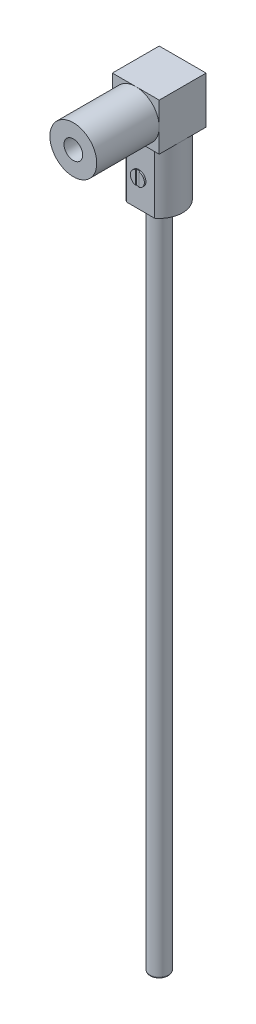
ISO-10303-21;
HEADER;
FILE_DESCRIPTION(('STEP AP214'),'2;1');
FILE_NAME('part.step','',(''),(''),'','','');
FILE_SCHEMA(('AUTOMOTIVE_DESIGN { 1 0 10303 214 1 1 1 1 }'));
ENDSEC;
DATA;
#1=APPLICATION_CONTEXT('core data for automotive mechanical design processes');
#2=APPLICATION_PROTOCOL_DEFINITION('international standard','automotive_design',2000,#1);
#3=PRODUCT_CONTEXT('',#1,'mechanical');
#4=PRODUCT('Part','Part','',(#3));
#5=PRODUCT_RELATED_PRODUCT_CATEGORY('part','',(#4));
#6=PRODUCT_DEFINITION_FORMATION('','',#4);
#7=PRODUCT_DEFINITION_CONTEXT('part definition',#1,'design');
#8=PRODUCT_DEFINITION('design','',#6,#7);
#9=PRODUCT_DEFINITION_SHAPE('','',#8);
#10=(LENGTH_UNIT() NAMED_UNIT(*) SI_UNIT(.MILLI.,.METRE.));
#11=(NAMED_UNIT(*) PLANE_ANGLE_UNIT() SI_UNIT($,.RADIAN.));
#12=(NAMED_UNIT(*) SI_UNIT($,.STERADIAN.) SOLID_ANGLE_UNIT());
#13=UNCERTAINTY_MEASURE_WITH_UNIT(LENGTH_MEASURE(1.E-05),#10,'distance_accuracy_value','');
#14=(GEOMETRIC_REPRESENTATION_CONTEXT(3) GLOBAL_UNCERTAINTY_ASSIGNED_CONTEXT((#13)) GLOBAL_UNIT_ASSIGNED_CONTEXT((#10,
#11,#12)) REPRESENTATION_CONTEXT('',''));
#15=CARTESIAN_POINT('',(0.,0.,0.));
#16=DIRECTION('',(0.,0.,1.));
#17=DIRECTION('',(1.,0.,0.));
#18=AXIS2_PLACEMENT_3D('',#15,#16,#17);
#19=CARTESIAN_POINT('',(15.,-21.5,29.));
#20=DIRECTION('',(0.,0.,1.));
#21=DIRECTION('',(1.,0.,0.));
#22=AXIS2_PLACEMENT_3D('',#19,#20,#21);
#23=PLANE('',#22);
#24=DIRECTION('',(0.,1.,0.));
#25=VECTOR('',#24,1.);
#26=CARTESIAN_POINT('',(16.2,-17.1629503115597,29.));
#27=LINE('',#26,#25);
#28=CARTESIAN_POINT('',(16.2,-25.8370496884403,29.));
#29=VERTEX_POINT('',#28);
#30=CARTESIAN_POINT('',(16.2,-17.1629503115597,29.));
#31=VERTEX_POINT('',#30);
#32=EDGE_CURVE('E147',#29,#31,#27,.T.);
#33=ORIENTED_EDGE('',*,*,#32,.F.);
#34=CARTESIAN_POINT('',(15.,-21.5,29.));
#35=DIRECTION('',(0.,0.,1.));
#36=DIRECTION('',(1.,0.,0.));
#37=AXIS2_PLACEMENT_3D('',#34,#35,#36);
#38=CIRCLE('',#37,4.5);
#39=EDGE_CURVE('E160',#29,#31,#38,.T.);
#40=ORIENTED_EDGE('',*,*,#39,.T.);
#41=EDGE_LOOP('',(#33,#40));
#42=FACE_BOUND('',#41,.T.);
#43=ADVANCED_FACE('F34',(#42),#23,.T.);
#44=CARTESIAN_POINT('',(0.,0.,30.));
#45=DIRECTION('',(0.,1.,0.));
#46=DIRECTION('',(0.,0.,1.));
#47=AXIS2_PLACEMENT_3D('',#44,#45,#46);
#48=PLANE('',#47);
#49=CARTESIAN_POINT('',(15.,0.,15.));
#50=DIRECTION('',(0.,-1.,0.));
#51=DIRECTION('',(0.,0.,-1.));
#52=AXIS2_PLACEMENT_3D('',#49,#50,#51);
#53=CIRCLE('',#52,15.);
#54=CARTESIAN_POINT('',(0.,0.,15.));
#55=VERTEX_POINT('',#54);
#56=CARTESIAN_POINT('',(15.,0.,0.));
#57=VERTEX_POINT('',#56);
#58=EDGE_CURVE('E178',#55,#57,#53,.T.);
#59=ORIENTED_EDGE('',*,*,#58,.F.);
#60=DIRECTION('',(0.,0.,-1.));
#61=VECTOR('',#60,1.);
#62=CARTESIAN_POINT('',(0.,0.,30.));
#63=LINE('',#62,#61);
#64=CARTESIAN_POINT('',(0.,0.,0.));
#65=VERTEX_POINT('',#64);
#66=EDGE_CURVE('E238',#55,#65,#63,.T.);
#67=ORIENTED_EDGE('',*,*,#66,.T.);
#68=DIRECTION('',(1.,0.,0.));
#69=VECTOR('',#68,1.);
#70=CARTESIAN_POINT('',(0.,0.,0.));
#71=LINE('',#70,#69);
#72=EDGE_CURVE('E222',#65,#57,#71,.T.);
#73=ORIENTED_EDGE('',*,*,#72,.T.);
#74=EDGE_LOOP('',(#59,#67,#73));
#75=FACE_BOUND('',#74,.T.);
#76=ADVANCED_FACE('F264',(#75),#48,.F.);
#77=CARTESIAN_POINT('',(30.,0.,15.));
#78=VERTEX_POINT('',#77);
#79=EDGE_CURVE('E184',#57,#78,#53,.T.);
#80=ORIENTED_EDGE('',*,*,#79,.F.);
#81=CARTESIAN_POINT('',(30.,0.,0.));
#82=VERTEX_POINT('',#81);
#83=EDGE_CURVE('E221',#57,#82,#71,.T.);
#84=ORIENTED_EDGE('',*,*,#83,.T.);
#85=DIRECTION('',(0.,0.,-1.));
#86=VECTOR('',#85,1.);
#87=CARTESIAN_POINT('',(30.,0.,30.));
#88=LINE('',#87,#86);
#89=EDGE_CURVE('E234',#78,#82,#88,.T.);
#90=ORIENTED_EDGE('',*,*,#89,.F.);
#91=EDGE_LOOP('',(#80,#84,#90));
#92=FACE_BOUND('',#91,.T.);
#93=ADVANCED_FACE('F270',(#92),#48,.F.);
#94=CARTESIAN_POINT('',(0.,0.,30.));
#95=DIRECTION('',(0.,0.,-1.));
#96=DIRECTION('',(-1.,0.,0.));
#97=AXIS2_PLACEMENT_3D('',#94,#95,#96);
#98=PLANE('',#97);
#99=CARTESIAN_POINT('',(15.,15.,30.));
#100=DIRECTION('',(0.,0.,1.));
#101=DIRECTION('',(1.,0.,0.));
#102=AXIS2_PLACEMENT_3D('',#99,#100,#101);
#103=CIRCLE('',#102,15.);
#104=CARTESIAN_POINT('',(30.,15.,30.));
#105=VERTEX_POINT('',#104);
#106=CARTESIAN_POINT('',(15.,30.,30.));
#107=VERTEX_POINT('',#106);
#108=EDGE_CURVE('E192',#105,#107,#103,.T.);
#109=ORIENTED_EDGE('',*,*,#108,.F.);
#110=DIRECTION('',(0.,1.,0.));
#111=VECTOR('',#110,1.);
#112=CARTESIAN_POINT('',(30.,0.,30.));
#113=LINE('',#112,#111);
#114=CARTESIAN_POINT('',(30.,30.,30.));
#115=VERTEX_POINT('',#114);
#116=EDGE_CURVE('E211',#105,#115,#113,.T.);
#117=ORIENTED_EDGE('',*,*,#116,.T.);
#118=DIRECTION('',(-1.,0.,0.));
#119=VECTOR('',#118,1.);
#120=CARTESIAN_POINT('',(0.,30.,30.));
#121=LINE('',#120,#119);
#122=EDGE_CURVE('E215',#115,#107,#121,.T.);
#123=ORIENTED_EDGE('',*,*,#122,.T.);
#124=EDGE_LOOP('',(#109,#117,#123));
#125=FACE_BOUND('',#124,.T.);
#126=ADVANCED_FACE('F323',(#125),#98,.F.);
#127=CARTESIAN_POINT('',(0.,15.,30.));
#128=VERTEX_POINT('',#127);
#129=EDGE_CURVE('E201',#107,#128,#103,.T.);
#130=ORIENTED_EDGE('',*,*,#129,.F.);
#131=CARTESIAN_POINT('',(0.,30.,30.));
#132=VERTEX_POINT('',#131);
#133=EDGE_CURVE('E214',#107,#132,#121,.T.);
#134=ORIENTED_EDGE('',*,*,#133,.T.);
#135=DIRECTION('',(0.,-1.,0.));
#136=VECTOR('',#135,1.);
#137=CARTESIAN_POINT('',(0.,0.,30.));
#138=LINE('',#137,#136);
#139=EDGE_CURVE('E203',#132,#128,#138,.T.);
#140=ORIENTED_EDGE('',*,*,#139,.T.);
#141=EDGE_LOOP('',(#130,#134,#140));
#142=FACE_BOUND('',#141,.T.);
#143=ADVANCED_FACE('F342',(#142),#98,.F.);
#144=CARTESIAN_POINT('',(15.,0.,30.));
#145=VERTEX_POINT('',#144);
#146=EDGE_CURVE('E375',#128,#145,#103,.T.);
#147=ORIENTED_EDGE('',*,*,#146,.F.);
#148=CARTESIAN_POINT('',(0.,0.,30.));
#149=VERTEX_POINT('',#148);
#150=EDGE_CURVE('E207',#128,#149,#138,.T.);
#151=ORIENTED_EDGE('',*,*,#150,.T.);
#152=DIRECTION('',(1.,0.,0.));
#153=VECTOR('',#152,1.);
#154=CARTESIAN_POINT('',(0.,0.,30.));
#155=LINE('',#154,#153);
#156=EDGE_CURVE('E208',#149,#145,#155,.T.);
#157=ORIENTED_EDGE('',*,*,#156,.T.);
#158=EDGE_LOOP('',(#147,#151,#157));
#159=FACE_BOUND('',#158,.T.);
#160=ADVANCED_FACE('F337',(#159),#98,.F.);
#161=CARTESIAN_POINT('',(0.,0.,30.));
#162=DIRECTION('',(1.,0.,0.));
#163=DIRECTION('',(0.,1.,0.));
#164=AXIS2_PLACEMENT_3D('',#161,#162,#163);
#165=PLANE('',#164);
#166=DIRECTION('',(0.,-1.,0.));
#167=VECTOR('',#166,1.);
#168=CARTESIAN_POINT('',(0.,0.,0.));
#169=LINE('',#168,#167);
#170=CARTESIAN_POINT('',(0.,30.,0.));
#171=VERTEX_POINT('',#170);
#172=EDGE_CURVE('E198',#171,#65,#169,.T.);
#173=ORIENTED_EDGE('',*,*,#172,.T.);
#174=ORIENTED_EDGE('',*,*,#66,.F.);
#175=EDGE_CURVE('E239',#149,#55,#63,.T.);
#176=ORIENTED_EDGE('',*,*,#175,.F.);
#177=ORIENTED_EDGE('',*,*,#150,.F.);
#178=ORIENTED_EDGE('',*,*,#139,.F.);
#179=DIRECTION('',(0.,0.,-1.));
#180=VECTOR('',#179,1.);
#181=CARTESIAN_POINT('',(0.,30.,30.));
#182=LINE('',#181,#180);
#183=EDGE_CURVE('E218',#132,#171,#182,.T.);
#184=ORIENTED_EDGE('',*,*,#183,.T.);
#185=EDGE_LOOP('',(#173,#174,#176,#177,#178,#184));
#186=FACE_BOUND('',#185,.T.);
#187=ADVANCED_FACE('F334',(#186),#165,.F.);
#188=CARTESIAN_POINT('',(24.,0.,27.));
#189=VERTEX_POINT('',#188);
#190=EDGE_CURVE('E187',#78,#189,#53,.T.);
#191=ORIENTED_EDGE('',*,*,#190,.F.);
#192=CARTESIAN_POINT('',(30.,0.,30.));
#193=VERTEX_POINT('',#192);
#194=EDGE_CURVE('E235',#193,#78,#88,.T.);
#195=ORIENTED_EDGE('',*,*,#194,.F.);
#196=EDGE_CURVE('E206',#145,#193,#155,.T.);
#197=ORIENTED_EDGE('',*,*,#196,.F.);
#198=ORIENTED_EDGE('',*,*,#156,.F.);
#199=ORIENTED_EDGE('',*,*,#175,.T.);
#200=CARTESIAN_POINT('',(6.00000000000001,0.,27.));
#201=VERTEX_POINT('',#200);
#202=EDGE_CURVE('E188',#201,#55,#53,.T.);
#203=ORIENTED_EDGE('',*,*,#202,.F.);
#204=DIRECTION('',(1.,0.,0.));
#205=VECTOR('',#204,1.);
#206=CARTESIAN_POINT('',(6.00000000000001,0.,27.));
#207=LINE('',#206,#205);
#208=EDGE_CURVE('E171',#201,#189,#207,.T.);
#209=ORIENTED_EDGE('',*,*,#208,.T.);
#210=EDGE_LOOP('',(#191,#195,#197,#198,#199,#203,#209));
#211=FACE_BOUND('',#210,.T.);
#212=ADVANCED_FACE('F273',(#211),#48,.F.);
#213=CARTESIAN_POINT('',(30.,0.,30.));
#214=DIRECTION('',(-1.,0.,0.));
#215=DIRECTION('',(0.,-1.,0.));
#216=AXIS2_PLACEMENT_3D('',#213,#214,#215);
#217=PLANE('',#216);
#218=DIRECTION('',(0.,1.,0.));
#219=VECTOR('',#218,1.);
#220=CARTESIAN_POINT('',(30.,0.,0.));
#221=LINE('',#220,#219);
#222=CARTESIAN_POINT('',(30.,30.,0.));
#223=VERTEX_POINT('',#222);
#224=EDGE_CURVE('E225',#82,#223,#221,.T.);
#225=ORIENTED_EDGE('',*,*,#224,.T.);
#226=DIRECTION('',(0.,0.,-1.));
#227=VECTOR('',#226,1.);
#228=CARTESIAN_POINT('',(30.,30.,30.));
#229=LINE('',#228,#227);
#230=EDGE_CURVE('E231',#115,#223,#229,.T.);
#231=ORIENTED_EDGE('',*,*,#230,.F.);
#232=ORIENTED_EDGE('',*,*,#116,.F.);
#233=EDGE_CURVE('E212',#193,#105,#113,.T.);
#234=ORIENTED_EDGE('',*,*,#233,.F.);
#235=ORIENTED_EDGE('',*,*,#194,.T.);
#236=ORIENTED_EDGE('',*,*,#89,.T.);
#237=EDGE_LOOP('',(#225,#231,#232,#234,#235,#236));
#238=FACE_BOUND('',#237,.T.);
#239=ADVANCED_FACE('F329',(#238),#217,.F.);
#240=CARTESIAN_POINT('',(0.,30.,30.));
#241=DIRECTION('',(0.,-1.,0.));
#242=DIRECTION('',(0.,0.,-1.));
#243=AXIS2_PLACEMENT_3D('',#240,#241,#242);
#244=PLANE('',#243);
#245=DIRECTION('',(-1.,0.,0.));
#246=VECTOR('',#245,1.);
#247=CARTESIAN_POINT('',(0.,30.,0.));
#248=LINE('',#247,#246);
#249=EDGE_CURVE('E227',#223,#171,#248,.T.);
#250=ORIENTED_EDGE('',*,*,#249,.T.);
#251=ORIENTED_EDGE('',*,*,#183,.F.);
#252=ORIENTED_EDGE('',*,*,#133,.F.);
#253=ORIENTED_EDGE('',*,*,#122,.F.);
#254=ORIENTED_EDGE('',*,*,#230,.T.);
#255=EDGE_LOOP('',(#250,#251,#252,#253,#254));
#256=FACE_BOUND('',#255,.T.);
#257=ADVANCED_FACE('F321',(#256),#244,.F.);
#258=EDGE_CURVE('E202',#145,#105,#103,.T.);
#259=ORIENTED_EDGE('',*,*,#258,.F.);
#260=ORIENTED_EDGE('',*,*,#196,.T.);
#261=ORIENTED_EDGE('',*,*,#233,.T.);
#262=EDGE_LOOP('',(#259,#260,#261));
#263=FACE_BOUND('',#262,.T.);
#264=ADVANCED_FACE('F318',(#263),#98,.F.);
#265=CARTESIAN_POINT('',(0.,0.,0.));
#266=DIRECTION('',(0.,0.,-1.));
#267=DIRECTION('',(-1.,0.,0.));
#268=AXIS2_PLACEMENT_3D('',#265,#266,#267);
#269=PLANE('',#268);
#270=ORIENTED_EDGE('',*,*,#172,.F.);
#271=ORIENTED_EDGE('',*,*,#249,.F.);
#272=ORIENTED_EDGE('',*,*,#224,.F.);
#273=ORIENTED_EDGE('',*,*,#83,.F.);
#274=ORIENTED_EDGE('',*,*,#72,.F.);
#275=EDGE_LOOP('',(#270,#271,#272,#273,#274));
#276=FACE_BOUND('',#275,.T.);
#277=ADVANCED_FACE('F313',(#276),#269,.T.);
#278=CARTESIAN_POINT('',(15.,15.,70.));
#279=DIRECTION('',(0.,0.,1.));
#280=DIRECTION('',(1.,0.,0.));
#281=AXIS2_PLACEMENT_3D('',#278,#279,#280);
#282=PLANE('',#281);
#283=CARTESIAN_POINT('',(15.,15.,70.));
#284=DIRECTION('',(0.,0.,1.));
#285=DIRECTION('',(1.,0.,0.));
#286=AXIS2_PLACEMENT_3D('',#283,#284,#285);
#287=CIRCLE('',#286,15.);
#288=CARTESIAN_POINT('',(30.,15.,70.));
#289=VERTEX_POINT('',#288);
#290=EDGE_CURVE('E195',#289,#289,#287,.T.);
#291=ORIENTED_EDGE('',*,*,#290,.T.);
#292=EDGE_LOOP('',(#291));
#293=FACE_BOUND('',#292,.T.);
#294=CARTESIAN_POINT('',(15.,15.,70.));
#295=DIRECTION('',(0.,0.,1.));
#296=DIRECTION('',(1.,0.,0.));
#297=AXIS2_PLACEMENT_3D('',#294,#295,#296);
#298=CIRCLE('',#297,6.);
#299=CARTESIAN_POINT('',(21.,15.,70.));
#300=VERTEX_POINT('',#299);
#301=EDGE_CURVE('E189',#300,#300,#298,.T.);
#302=ORIENTED_EDGE('',*,*,#301,.F.);
#303=EDGE_LOOP('',(#302));
#304=FACE_BOUND('',#303,.T.);
#305=ADVANCED_FACE('F310',(#293,#304),#282,.T.);
#306=CARTESIAN_POINT('',(15.,15.,70.));
#307=DIRECTION('',(0.,0.,-1.));
#308=DIRECTION('',(-1.,0.,0.));
#309=AXIS2_PLACEMENT_3D('',#306,#307,#308);
#310=CYLINDRICAL_SURFACE('',#309,15.);
#311=ORIENTED_EDGE('',*,*,#290,.F.);
#312=EDGE_LOOP('',(#311));
#313=FACE_BOUND('',#312,.T.);
#314=ORIENTED_EDGE('',*,*,#108,.T.);
#315=ORIENTED_EDGE('',*,*,#129,.T.);
#316=ORIENTED_EDGE('',*,*,#146,.T.);
#317=ORIENTED_EDGE('',*,*,#258,.T.);
#318=EDGE_LOOP('',(#314,#315,#316,#317));
#319=FACE_BOUND('',#318,.T.);
#320=ADVANCED_FACE('F308',(#313,#319),#310,.T.);
#321=CARTESIAN_POINT('',(15.,15.,70.));
#322=DIRECTION('',(0.,0.,-1.));
#323=DIRECTION('',(-1.,0.,0.));
#324=AXIS2_PLACEMENT_3D('',#321,#322,#323);
#325=CYLINDRICAL_SURFACE('',#324,6.);
#326=ORIENTED_EDGE('',*,*,#301,.T.);
#327=EDGE_LOOP('',(#326));
#328=FACE_BOUND('',#327,.T.);
#329=CARTESIAN_POINT('',(15.,15.,30.));
#330=DIRECTION('',(0.,0.,1.));
#331=DIRECTION('',(1.,0.,0.));
#332=AXIS2_PLACEMENT_3D('',#329,#330,#331);
#333=CIRCLE('',#332,6.);
#334=CARTESIAN_POINT('',(21.,15.,30.));
#335=VERTEX_POINT('',#334);
#336=EDGE_CURVE('E183',#335,#335,#333,.T.);
#337=ORIENTED_EDGE('',*,*,#336,.F.);
#338=EDGE_LOOP('',(#337));
#339=FACE_BOUND('',#338,.T.);
#340=ADVANCED_FACE('F305',(#328,#339),#325,.F.);
#341=ORIENTED_EDGE('',*,*,#336,.T.);
#342=EDGE_LOOP('',(#341));
#343=FACE_BOUND('',#342,.T.);
#344=ADVANCED_FACE('F303',(#343),#98,.F.);
#345=CARTESIAN_POINT('',(15.,-40.,15.));
#346=DIRECTION('',(0.,1.,0.));
#347=DIRECTION('',(0.,0.,1.));
#348=AXIS2_PLACEMENT_3D('',#345,#346,#347);
#349=CYLINDRICAL_SURFACE('',#348,15.);
#350=CARTESIAN_POINT('',(15.,-40.,15.));
#351=DIRECTION('',(0.,-1.,0.));
#352=DIRECTION('',(0.,0.,-1.));
#353=AXIS2_PLACEMENT_3D('',#350,#351,#352);
#354=CIRCLE('',#353,15.);
#355=CARTESIAN_POINT('',(6.00000000000001,-40.,27.));
#356=VERTEX_POINT('',#355);
#357=CARTESIAN_POINT('',(24.,-40.,27.));
#358=VERTEX_POINT('',#357);
#359=EDGE_CURVE('E180',#356,#358,#354,.T.);
#360=ORIENTED_EDGE('',*,*,#359,.F.);
#361=DIRECTION('',(0.,-1.,0.));
#362=VECTOR('',#361,1.);
#363=CARTESIAN_POINT('',(6.00000000000001,0.,27.));
#364=LINE('',#363,#362);
#365=EDGE_CURVE('E57',#201,#356,#364,.T.);
#366=ORIENTED_EDGE('',*,*,#365,.F.);
#367=ORIENTED_EDGE('',*,*,#202,.T.);
#368=ORIENTED_EDGE('',*,*,#58,.T.);
#369=ORIENTED_EDGE('',*,*,#79,.T.);
#370=ORIENTED_EDGE('',*,*,#190,.T.);
#371=DIRECTION('',(0.,-1.,0.));
#372=VECTOR('',#371,1.);
#373=CARTESIAN_POINT('',(24.,0.,27.));
#374=LINE('',#373,#372);
#375=EDGE_CURVE('E175',#189,#358,#374,.T.);
#376=ORIENTED_EDGE('',*,*,#375,.T.);
#377=EDGE_LOOP('',(#360,#366,#367,#368,#369,#370,#376));
#378=FACE_BOUND('',#377,.T.);
#379=ADVANCED_FACE('F299',(#378),#349,.T.);
#380=CARTESIAN_POINT('',(15.,-40.,15.));
#381=DIRECTION('',(0.,-1.,0.));
#382=DIRECTION('',(0.,0.,-1.));
#383=AXIS2_PLACEMENT_3D('',#380,#381,#382);
#384=PLANE('',#383);
#385=CARTESIAN_POINT('',(15.,-40.,15.));
#386=DIRECTION('',(0.,-1.,0.));
#387=DIRECTION('',(0.,0.,-1.));
#388=AXIS2_PLACEMENT_3D('',#385,#386,#387);
#389=CIRCLE('',#388,6.);
#390=CARTESIAN_POINT('',(15.,-40.,9.));
#391=VERTEX_POINT('',#390);
#392=EDGE_CURVE('E244',#391,#391,#389,.T.);
#393=ORIENTED_EDGE('',*,*,#392,.F.);
#394=EDGE_LOOP('',(#393));
#395=FACE_BOUND('',#394,.T.);
#396=DIRECTION('',(1.,0.,0.));
#397=VECTOR('',#396,1.);
#398=CARTESIAN_POINT('',(6.00000000000001,-40.,27.));
#399=LINE('',#398,#397);
#400=EDGE_CURVE('E170',#356,#358,#399,.T.);
#401=ORIENTED_EDGE('',*,*,#400,.F.);
#402=ORIENTED_EDGE('',*,*,#359,.T.);
#403=EDGE_LOOP('',(#401,#402));
#404=FACE_BOUND('',#403,.T.);
#405=ADVANCED_FACE('F295',(#395,#404),#384,.T.);
#406=CARTESIAN_POINT('',(6.00000000000001,0.,27.));
#407=DIRECTION('',(0.,0.,-1.));
#408=DIRECTION('',(-1.,0.,0.));
#409=AXIS2_PLACEMENT_3D('',#406,#407,#408);
#410=PLANE('',#409);
#411=CARTESIAN_POINT('',(15.,-21.5,27.));
#412=DIRECTION('',(0.,0.,-1.));
#413=DIRECTION('',(-1.,0.,0.));
#414=AXIS2_PLACEMENT_3D('',#411,#412,#413);
#415=CIRCLE('',#414,3.);
#416=CARTESIAN_POINT('',(12.,-21.5,27.));
#417=VERTEX_POINT('',#416);
#418=EDGE_CURVE('E242',#417,#417,#415,.F.);
#419=ORIENTED_EDGE('',*,*,#418,.F.);
#420=EDGE_LOOP('',(#419));
#421=FACE_BOUND('',#420,.T.);
#422=ORIENTED_EDGE('',*,*,#400,.T.);
#423=ORIENTED_EDGE('',*,*,#375,.F.);
#424=ORIENTED_EDGE('',*,*,#208,.F.);
#425=ORIENTED_EDGE('',*,*,#365,.T.);
#426=EDGE_LOOP('',(#422,#423,#424,#425));
#427=FACE_BOUND('',#426,.T.);
#428=ADVANCED_FACE('F289',(#421,#427),#410,.F.);
#429=CARTESIAN_POINT('',(15.,-21.5,28.));
#430=DIRECTION('',(0.,0.,-1.));
#431=DIRECTION('',(-1.,0.,0.));
#432=AXIS2_PLACEMENT_3D('',#429,#430,#431);
#433=CYLINDRICAL_SURFACE('',#432,3.);
#434=CARTESIAN_POINT('',(15.,-21.5,28.));
#435=DIRECTION('',(0.,0.,1.));
#436=DIRECTION('',(1.,0.,0.));
#437=AXIS2_PLACEMENT_3D('',#434,#435,#436);
#438=CIRCLE('',#437,3.);
#439=CARTESIAN_POINT('',(18.,-21.5,28.));
#440=VERTEX_POINT('',#439);
#441=EDGE_CURVE('E167',#440,#440,#438,.T.);
#442=ORIENTED_EDGE('',*,*,#441,.F.);
#443=EDGE_LOOP('',(#442));
#444=FACE_BOUND('',#443,.T.);
#445=ORIENTED_EDGE('',*,*,#418,.T.);
#446=EDGE_LOOP('',(#445));
#447=FACE_BOUND('',#446,.T.);
#448=ADVANCED_FACE('F284',(#444,#447),#433,.T.);
#449=CARTESIAN_POINT('',(15.,-21.5,29.));
#450=DIRECTION('',(0.,0.,-1.));
#451=DIRECTION('',(-1.,0.,0.));
#452=AXIS2_PLACEMENT_3D('',#449,#450,#451);
#453=CYLINDRICAL_SURFACE('',#452,4.5);
#454=CARTESIAN_POINT('',(15.,-21.5,28.5));
#455=DIRECTION('',(0.,0.,1.));
#456=DIRECTION('',(1.,0.,0.));
#457=AXIS2_PLACEMENT_3D('',#454,#455,#456);
#458=CIRCLE('',#457,4.5);
#459=CARTESIAN_POINT('',(16.2,-17.1629503115597,28.5));
#460=VERTEX_POINT('',#459);
#461=CARTESIAN_POINT('',(13.8,-17.1629503115597,28.5));
#462=VERTEX_POINT('',#461);
#463=EDGE_CURVE('E138',#460,#462,#458,.T.);
#464=ORIENTED_EDGE('',*,*,#463,.F.);
#465=DIRECTION('',(0.,0.,1.));
#466=VECTOR('',#465,1.);
#467=CARTESIAN_POINT('',(16.2,-17.1629503115597,28.5));
#468=LINE('',#467,#466);
#469=EDGE_CURVE('E166',#460,#31,#468,.T.);
#470=ORIENTED_EDGE('',*,*,#469,.T.);
#471=ORIENTED_EDGE('',*,*,#39,.F.);
#472=DIRECTION('',(0.,0.,1.));
#473=VECTOR('',#472,1.);
#474=CARTESIAN_POINT('',(16.2,-25.8370496884403,28.5));
#475=LINE('',#474,#473);
#476=CARTESIAN_POINT('',(16.2,-25.8370496884403,28.5));
#477=VERTEX_POINT('',#476);
#478=EDGE_CURVE('E155',#477,#29,#475,.T.);
#479=ORIENTED_EDGE('',*,*,#478,.F.);
#480=CARTESIAN_POINT('',(15.,-21.5,28.5));
#481=DIRECTION('',(0.,0.,1.));
#482=DIRECTION('',(1.,0.,0.));
#483=AXIS2_PLACEMENT_3D('',#480,#481,#482);
#484=CIRCLE('',#483,4.5);
#485=CARTESIAN_POINT('',(13.8,-25.8370496884403,28.5));
#486=VERTEX_POINT('',#485);
#487=EDGE_CURVE('E137',#486,#477,#484,.T.);
#488=ORIENTED_EDGE('',*,*,#487,.F.);
#489=DIRECTION('',(0.,0.,1.));
#490=VECTOR('',#489,1.);
#491=CARTESIAN_POINT('',(13.8,-25.8370496884403,28.5));
#492=LINE('',#491,#490);
#493=CARTESIAN_POINT('',(13.8,-25.8370496884403,29.));
#494=VERTEX_POINT('',#493);
#495=EDGE_CURVE('E134',#486,#494,#492,.T.);
#496=ORIENTED_EDGE('',*,*,#495,.T.);
#497=CARTESIAN_POINT('',(13.8,-17.1629503115597,29.));
#498=VERTEX_POINT('',#497);
#499=EDGE_CURVE('E153',#498,#494,#38,.T.);
#500=ORIENTED_EDGE('',*,*,#499,.F.);
#501=DIRECTION('',(0.,0.,1.));
#502=VECTOR('',#501,1.);
#503=CARTESIAN_POINT('',(13.8,-17.1629503115597,28.5));
#504=LINE('',#503,#502);
#505=EDGE_CURVE('E49',#462,#498,#504,.T.);
#506=ORIENTED_EDGE('',*,*,#505,.F.);
#507=EDGE_LOOP('',(#464,#470,#471,#479,#488,#496,#500,#506));
#508=FACE_BOUND('',#507,.T.);
#509=CARTESIAN_POINT('',(15.,-21.5,28.));
#510=DIRECTION('',(0.,0.,1.));
#511=DIRECTION('',(1.,0.,0.));
#512=AXIS2_PLACEMENT_3D('',#509,#510,#511);
#513=CIRCLE('',#512,4.5);
#514=CARTESIAN_POINT('',(19.5,-21.5,28.));
#515=VERTEX_POINT('',#514);
#516=EDGE_CURVE('E163',#515,#515,#513,.T.);
#517=ORIENTED_EDGE('',*,*,#516,.T.);
#518=EDGE_LOOP('',(#517));
#519=FACE_BOUND('',#518,.T.);
#520=ADVANCED_FACE('F150',(#508,#519),#453,.T.);
#521=DIRECTION('',(0.,-1.,0.));
#522=VECTOR('',#521,1.);
#523=CARTESIAN_POINT('',(13.8,-17.1629503115597,29.));
#524=LINE('',#523,#522);
#525=EDGE_CURVE('E254',#498,#494,#524,.T.);
#526=ORIENTED_EDGE('',*,*,#525,.F.);
#527=ORIENTED_EDGE('',*,*,#499,.T.);
#528=EDGE_LOOP('',(#526,#527));
#529=FACE_BOUND('',#528,.T.);
#530=ADVANCED_FACE('F266',(#529),#23,.T.);
#531=CARTESIAN_POINT('',(15.,-21.5,28.));
#532=DIRECTION('',(0.,0.,1.));
#533=DIRECTION('',(1.,0.,0.));
#534=AXIS2_PLACEMENT_3D('',#531,#532,#533);
#535=PLANE('',#534);
#536=ORIENTED_EDGE('',*,*,#441,.T.);
#537=EDGE_LOOP('',(#536));
#538=FACE_BOUND('',#537,.T.);
#539=ORIENTED_EDGE('',*,*,#516,.F.);
#540=EDGE_LOOP('',(#539));
#541=FACE_BOUND('',#540,.T.);
#542=ADVANCED_FACE('F277',(#538,#541),#535,.F.);
#543=CARTESIAN_POINT('',(16.2,-17.1629503115597,28.5));
#544=DIRECTION('',(1.,0.,0.));
#545=DIRECTION('',(0.,1.,0.));
#546=AXIS2_PLACEMENT_3D('',#543,#544,#545);
#547=PLANE('',#546);
#548=ORIENTED_EDGE('',*,*,#32,.T.);
#549=ORIENTED_EDGE('',*,*,#469,.F.);
#550=DIRECTION('',(0.,1.,0.));
#551=VECTOR('',#550,1.);
#552=CARTESIAN_POINT('',(16.2,-17.1629503115597,28.5));
#553=LINE('',#552,#551);
#554=EDGE_CURVE('E144',#477,#460,#553,.T.);
#555=ORIENTED_EDGE('',*,*,#554,.F.);
#556=ORIENTED_EDGE('',*,*,#478,.T.);
#557=EDGE_LOOP('',(#548,#549,#555,#556));
#558=FACE_BOUND('',#557,.T.);
#559=ADVANCED_FACE('F260',(#558),#547,.F.);
#560=CARTESIAN_POINT('',(13.8,-17.1629503115597,28.5));
#561=DIRECTION('',(-1.,0.,0.));
#562=DIRECTION('',(0.,-1.,0.));
#563=AXIS2_PLACEMENT_3D('',#560,#561,#562);
#564=PLANE('',#563);
#565=ORIENTED_EDGE('',*,*,#525,.T.);
#566=ORIENTED_EDGE('',*,*,#495,.F.);
#567=DIRECTION('',(0.,-1.,0.));
#568=VECTOR('',#567,1.);
#569=CARTESIAN_POINT('',(13.8,-17.1629503115597,28.5));
#570=LINE('',#569,#568);
#571=EDGE_CURVE('E130',#462,#486,#570,.T.);
#572=ORIENTED_EDGE('',*,*,#571,.F.);
#573=ORIENTED_EDGE('',*,*,#505,.T.);
#574=EDGE_LOOP('',(#565,#566,#572,#573));
#575=FACE_BOUND('',#574,.T.);
#576=ADVANCED_FACE('F132',(#575),#564,.F.);
#577=CARTESIAN_POINT('',(15.,-21.5,28.5));
#578=DIRECTION('',(0.,0.,1.));
#579=DIRECTION('',(1.,0.,0.));
#580=AXIS2_PLACEMENT_3D('',#577,#578,#579);
#581=PLANE('',#580);
#582=ORIENTED_EDGE('',*,*,#463,.T.);
#583=ORIENTED_EDGE('',*,*,#571,.T.);
#584=ORIENTED_EDGE('',*,*,#487,.T.);
#585=ORIENTED_EDGE('',*,*,#554,.T.);
#586=EDGE_LOOP('',(#582,#583,#584,#585));
#587=FACE_BOUND('',#586,.T.);
#588=ADVANCED_FACE('F142',(#587),#581,.T.);
#589=CARTESIAN_POINT('',(15.,-468.,15.));
#590=DIRECTION('',(0.,1.,0.));
#591=DIRECTION('',(0.,0.,1.));
#592=AXIS2_PLACEMENT_3D('',#589,#590,#591);
#593=CYLINDRICAL_SURFACE('',#592,6.);
#594=CARTESIAN_POINT('',(15.,-467.,15.));
#595=DIRECTION('',(0.,-1.,0.));
#596=DIRECTION('',(0.,0.,-1.));
#597=AXIS2_PLACEMENT_3D('',#594,#595,#596);
#598=CIRCLE('',#597,6.);
#599=CARTESIAN_POINT('',(15.,-467.,9.));
#600=VERTEX_POINT('',#599);
#601=EDGE_CURVE('E11',#600,#600,#598,.F.);
#602=ORIENTED_EDGE('',*,*,#601,.T.);
#603=EDGE_LOOP('',(#602));
#604=FACE_BOUND('',#603,.T.);
#605=ORIENTED_EDGE('',*,*,#392,.T.);
#606=EDGE_LOOP('',(#605));
#607=FACE_BOUND('',#606,.T.);
#608=ADVANCED_FACE('F519',(#604,#607),#593,.T.);
#609=CARTESIAN_POINT('',(15.,-468.,15.));
#610=DIRECTION('',(0.,-1.,0.));
#611=DIRECTION('',(0.,0.,-1.));
#612=AXIS2_PLACEMENT_3D('',#609,#610,#611);
#613=PLANE('',#612);
#614=CARTESIAN_POINT('',(15.,-468.,15.));
#615=DIRECTION('',(0.,-1.,0.));
#616=DIRECTION('',(0.,0.,-1.));
#617=AXIS2_PLACEMENT_3D('',#614,#615,#616);
#618=CIRCLE('',#617,5.);
#619=CARTESIAN_POINT('',(15.,-468.,10.));
#620=VERTEX_POINT('',#619);
#621=EDGE_CURVE('E42',#620,#620,#618,.T.);
#622=ORIENTED_EDGE('',*,*,#621,.T.);
#623=EDGE_LOOP('',(#622));
#624=FACE_BOUND('',#623,.T.);
#625=ADVANCED_FACE('F534',(#624),#613,.T.);
#626=CARTESIAN_POINT('',(15.,-467.,15.));
#627=DIRECTION('',(0.,-1.,0.));
#628=DIRECTION('',(0.,0.,-1.));
#629=AXIS2_PLACEMENT_3D('',#626,#627,#628);
#630=TOROIDAL_SURFACE('',#629,5.,1.);
#631=ORIENTED_EDGE('',*,*,#601,.F.);
#632=EDGE_LOOP('',(#631));
#633=FACE_BOUND('',#632,.T.);
#634=ORIENTED_EDGE('',*,*,#621,.F.);
#635=EDGE_LOOP('',(#634));
#636=FACE_BOUND('',#635,.T.);
#637=ADVANCED_FACE('F36',(#633,#636),#630,.T.);
#638=CLOSED_SHELL('',(#43,#76,#93,#126,#143,#160,#187,#212,#239,#257,#264,#277,#305,#320,#340,
#344,#379,#405,#428,#448,#520,#530,#542,#559,#576,#588,#608,#625,#637));
#639=MANIFOLD_SOLID_BREP('B2',#638);
#640=ADVANCED_BREP_SHAPE_REPRESENTATION('',(#18,#639),#14);
#641=SHAPE_DEFINITION_REPRESENTATION(#9,#640);
ENDSEC;
END-ISO-10303-21;
